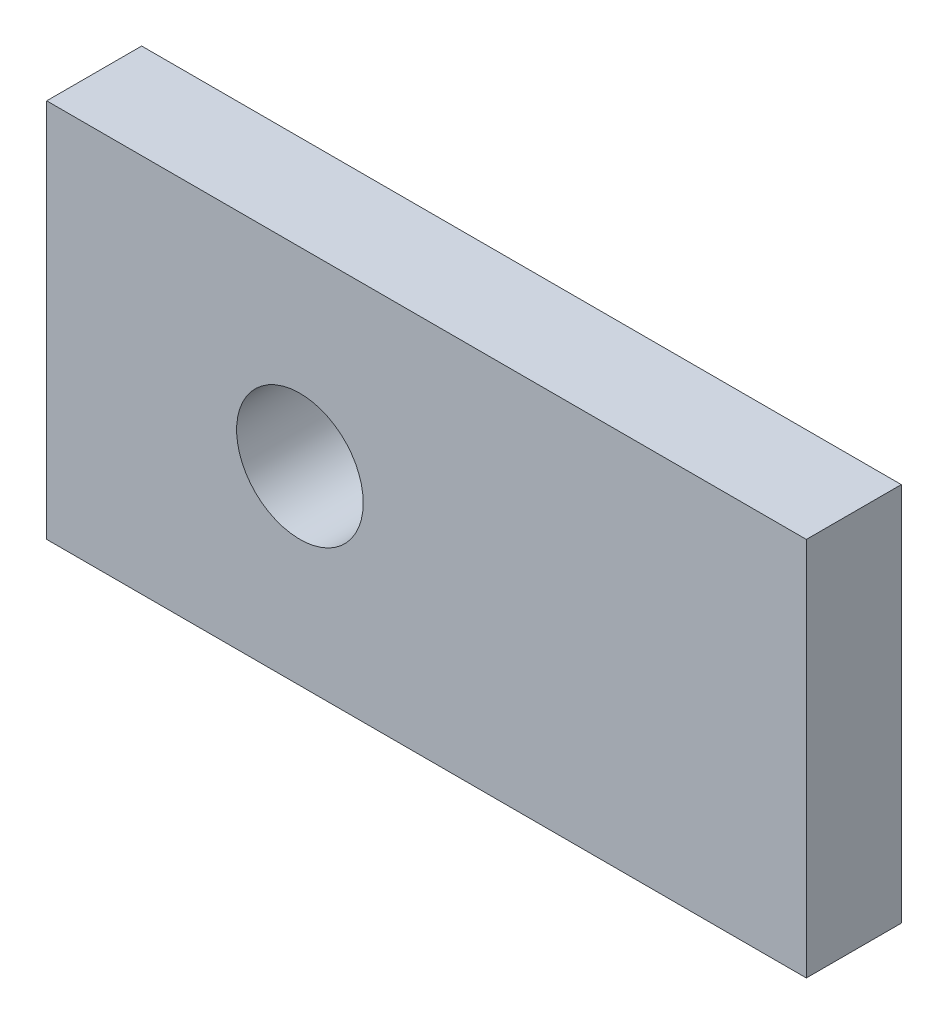
ISO-10303-21;
HEADER;
FILE_DESCRIPTION(('STEP AP214'),'2;1');
FILE_NAME('part.step','',(''),(''),'','','');
FILE_SCHEMA(('AUTOMOTIVE_DESIGN { 1 0 10303 214 1 1 1 1 }'));
ENDSEC;
DATA;
#1=APPLICATION_CONTEXT('core data for automotive mechanical design processes');
#2=APPLICATION_PROTOCOL_DEFINITION('international standard','automotive_design',2000,#1);
#3=PRODUCT_CONTEXT('',#1,'mechanical');
#4=PRODUCT('Part','Part','',(#3));
#5=PRODUCT_RELATED_PRODUCT_CATEGORY('part','',(#4));
#6=PRODUCT_DEFINITION_FORMATION('','',#4);
#7=PRODUCT_DEFINITION_CONTEXT('part definition',#1,'design');
#8=PRODUCT_DEFINITION('design','',#6,#7);
#9=PRODUCT_DEFINITION_SHAPE('','',#8);
#10=(LENGTH_UNIT() NAMED_UNIT(*) SI_UNIT(.MILLI.,.METRE.));
#11=(NAMED_UNIT(*) PLANE_ANGLE_UNIT() SI_UNIT($,.RADIAN.));
#12=(NAMED_UNIT(*) SI_UNIT($,.STERADIAN.) SOLID_ANGLE_UNIT());
#13=UNCERTAINTY_MEASURE_WITH_UNIT(LENGTH_MEASURE(1.E-05),#10,'distance_accuracy_value','');
#14=(GEOMETRIC_REPRESENTATION_CONTEXT(3) GLOBAL_UNCERTAINTY_ASSIGNED_CONTEXT((#13)) GLOBAL_UNIT_ASSIGNED_CONTEXT((#10,
#11,#12)) REPRESENTATION_CONTEXT('',''));
#15=CARTESIAN_POINT('',(0.,0.,0.));
#16=DIRECTION('',(0.,0.,1.));
#17=DIRECTION('',(1.,0.,0.));
#18=AXIS2_PLACEMENT_3D('',#15,#16,#17);
#19=CARTESIAN_POINT('',(60.,-30.,7.5));
#20=DIRECTION('',(0.,1.,0.));
#21=DIRECTION('',(0.,0.,1.));
#22=AXIS2_PLACEMENT_3D('',#19,#20,#21);
#23=PLANE('',#22);
#24=DIRECTION('',(0.,0.,-1.));
#25=VECTOR('',#24,1.);
#26=CARTESIAN_POINT('',(-60.,-30.,7.5));
#27=LINE('',#26,#25);
#28=CARTESIAN_POINT('',(-60.,-30.,7.5));
#29=VERTEX_POINT('',#28);
#30=CARTESIAN_POINT('',(-60.,-30.,-7.5));
#31=VERTEX_POINT('',#30);
#32=EDGE_CURVE('E117',#29,#31,#27,.T.);
#33=ORIENTED_EDGE('',*,*,#32,.T.);
#34=DIRECTION('',(-1.,0.,0.));
#35=VECTOR('',#34,1.);
#36=CARTESIAN_POINT('',(60.,-30.,-7.5));
#37=LINE('',#36,#35);
#38=CARTESIAN_POINT('',(60.,-30.,-7.5));
#39=VERTEX_POINT('',#38);
#40=EDGE_CURVE('E13',#39,#31,#37,.T.);
#41=ORIENTED_EDGE('',*,*,#40,.F.);
#42=DIRECTION('',(0.,0.,-1.));
#43=VECTOR('',#42,1.);
#44=CARTESIAN_POINT('',(60.,-30.,7.5));
#45=LINE('',#44,#43);
#46=CARTESIAN_POINT('',(60.,-30.,7.5));
#47=VERTEX_POINT('',#46);
#48=EDGE_CURVE('E104',#47,#39,#45,.T.);
#49=ORIENTED_EDGE('',*,*,#48,.F.);
#50=DIRECTION('',(-1.,0.,0.));
#51=VECTOR('',#50,1.);
#52=CARTESIAN_POINT('',(60.,-30.,7.5));
#53=LINE('',#52,#51);
#54=EDGE_CURVE('E112',#47,#29,#53,.T.);
#55=ORIENTED_EDGE('',*,*,#54,.T.);
#56=EDGE_LOOP('',(#33,#41,#49,#55));
#57=FACE_BOUND('',#56,.T.);
#58=ADVANCED_FACE('F53',(#57),#23,.F.);
#59=CARTESIAN_POINT('',(60.,-30.,-7.5));
#60=DIRECTION('',(0.,0.,1.));
#61=DIRECTION('',(1.,0.,0.));
#62=AXIS2_PLACEMENT_3D('',#59,#60,#61);
#63=PLANE('',#62);
#64=CARTESIAN_POINT('',(-20.,0.,-7.5));
#65=DIRECTION('',(0.,0.,1.));
#66=DIRECTION('',(1.,0.,0.));
#67=AXIS2_PLACEMENT_3D('',#64,#65,#66);
#68=CIRCLE('',#67,10.);
#69=CARTESIAN_POINT('',(-10.,0.,-7.5));
#70=VERTEX_POINT('',#69);
#71=EDGE_CURVE('E133',#70,#70,#68,.T.);
#72=ORIENTED_EDGE('',*,*,#71,.T.);
#73=EDGE_LOOP('',(#72));
#74=FACE_BOUND('',#73,.T.);
#75=DIRECTION('',(0.,1.,0.));
#76=VECTOR('',#75,1.);
#77=CARTESIAN_POINT('',(-60.,-30.,-7.5));
#78=LINE('',#77,#76);
#79=CARTESIAN_POINT('',(-60.,30.,-7.5));
#80=VERTEX_POINT('',#79);
#81=EDGE_CURVE('E108',#31,#80,#78,.T.);
#82=ORIENTED_EDGE('',*,*,#81,.T.);
#83=DIRECTION('',(-1.,0.,0.));
#84=VECTOR('',#83,1.);
#85=CARTESIAN_POINT('',(60.,30.,-7.5));
#86=LINE('',#85,#84);
#87=CARTESIAN_POINT('',(60.,30.,-7.5));
#88=VERTEX_POINT('',#87);
#89=EDGE_CURVE('E61',#88,#80,#86,.T.);
#90=ORIENTED_EDGE('',*,*,#89,.F.);
#91=DIRECTION('',(0.,1.,0.));
#92=VECTOR('',#91,1.);
#93=CARTESIAN_POINT('',(60.,-30.,-7.5));
#94=LINE('',#93,#92);
#95=EDGE_CURVE('E99',#39,#88,#94,.T.);
#96=ORIENTED_EDGE('',*,*,#95,.F.);
#97=ORIENTED_EDGE('',*,*,#40,.T.);
#98=EDGE_LOOP('',(#82,#90,#96,#97));
#99=FACE_BOUND('',#98,.T.);
#100=ADVANCED_FACE('F107',(#74,#99),#63,.F.);
#101=CARTESIAN_POINT('',(60.,30.,7.5));
#102=DIRECTION('',(0.,-1.,0.));
#103=DIRECTION('',(0.,0.,-1.));
#104=AXIS2_PLACEMENT_3D('',#101,#102,#103);
#105=PLANE('',#104);
#106=DIRECTION('',(0.,0.,1.));
#107=VECTOR('',#106,1.);
#108=CARTESIAN_POINT('',(-60.,30.,7.5));
#109=LINE('',#108,#107);
#110=CARTESIAN_POINT('',(-60.,30.,7.5));
#111=VERTEX_POINT('',#110);
#112=EDGE_CURVE('E86',#80,#111,#109,.T.);
#113=ORIENTED_EDGE('',*,*,#112,.T.);
#114=DIRECTION('',(-1.,0.,0.));
#115=VECTOR('',#114,1.);
#116=CARTESIAN_POINT('',(60.,30.,7.5));
#117=LINE('',#116,#115);
#118=CARTESIAN_POINT('',(60.,30.,7.5));
#119=VERTEX_POINT('',#118);
#120=EDGE_CURVE('E109',#119,#111,#117,.T.);
#121=ORIENTED_EDGE('',*,*,#120,.F.);
#122=DIRECTION('',(0.,0.,1.));
#123=VECTOR('',#122,1.);
#124=CARTESIAN_POINT('',(60.,30.,7.5));
#125=LINE('',#124,#123);
#126=EDGE_CURVE('E102',#88,#119,#125,.T.);
#127=ORIENTED_EDGE('',*,*,#126,.F.);
#128=ORIENTED_EDGE('',*,*,#89,.T.);
#129=EDGE_LOOP('',(#113,#121,#127,#128));
#130=FACE_BOUND('',#129,.T.);
#131=ADVANCED_FACE('F110',(#130),#105,.F.);
#132=CARTESIAN_POINT('',(60.,-30.,7.5));
#133=DIRECTION('',(0.,0.,-1.));
#134=DIRECTION('',(-1.,0.,0.));
#135=AXIS2_PLACEMENT_3D('',#132,#133,#134);
#136=PLANE('',#135);
#137=CARTESIAN_POINT('',(-20.,0.,7.5));
#138=DIRECTION('',(0.,0.,1.));
#139=DIRECTION('',(1.,0.,0.));
#140=AXIS2_PLACEMENT_3D('',#137,#138,#139);
#141=CIRCLE('',#140,10.);
#142=CARTESIAN_POINT('',(-10.,0.,7.5));
#143=VERTEX_POINT('',#142);
#144=EDGE_CURVE('E136',#143,#143,#141,.T.);
#145=ORIENTED_EDGE('',*,*,#144,.F.);
#146=EDGE_LOOP('',(#145));
#147=FACE_BOUND('',#146,.T.);
#148=DIRECTION('',(0.,-1.,0.));
#149=VECTOR('',#148,1.);
#150=CARTESIAN_POINT('',(-60.,-30.,7.5));
#151=LINE('',#150,#149);
#152=EDGE_CURVE('E92',#111,#29,#151,.T.);
#153=ORIENTED_EDGE('',*,*,#152,.T.);
#154=ORIENTED_EDGE('',*,*,#54,.F.);
#155=DIRECTION('',(0.,-1.,0.));
#156=VECTOR('',#155,1.);
#157=CARTESIAN_POINT('',(60.,-30.,7.5));
#158=LINE('',#157,#156);
#159=EDGE_CURVE('E69',#119,#47,#158,.T.);
#160=ORIENTED_EDGE('',*,*,#159,.F.);
#161=ORIENTED_EDGE('',*,*,#120,.T.);
#162=EDGE_LOOP('',(#153,#154,#160,#161));
#163=FACE_BOUND('',#162,.T.);
#164=ADVANCED_FACE('F128',(#147,#163),#136,.F.);
#165=CARTESIAN_POINT('',(60.,-30.,-7.5));
#166=DIRECTION('',(1.,0.,0.));
#167=DIRECTION('',(0.,0.,-1.));
#168=AXIS2_PLACEMENT_3D('',#165,#166,#167);
#169=PLANE('',#168);
#170=ORIENTED_EDGE('',*,*,#48,.T.);
#171=ORIENTED_EDGE('',*,*,#95,.T.);
#172=ORIENTED_EDGE('',*,*,#126,.T.);
#173=ORIENTED_EDGE('',*,*,#159,.T.);
#174=EDGE_LOOP('',(#170,#171,#172,#173));
#175=FACE_BOUND('',#174,.T.);
#176=ADVANCED_FACE('F100',(#175),#169,.T.);
#177=CARTESIAN_POINT('',(-60.,-30.,-7.5));
#178=DIRECTION('',(1.,0.,0.));
#179=DIRECTION('',(0.,0.,-1.));
#180=AXIS2_PLACEMENT_3D('',#177,#178,#179);
#181=PLANE('',#180);
#182=ORIENTED_EDGE('',*,*,#32,.F.);
#183=ORIENTED_EDGE('',*,*,#152,.F.);
#184=ORIENTED_EDGE('',*,*,#112,.F.);
#185=ORIENTED_EDGE('',*,*,#81,.F.);
#186=EDGE_LOOP('',(#182,#183,#184,#185));
#187=FACE_BOUND('',#186,.T.);
#188=ADVANCED_FACE('F131',(#187),#181,.F.);
#189=CARTESIAN_POINT('',(-20.,0.,-12.5));
#190=DIRECTION('',(0.,0.,1.));
#191=DIRECTION('',(1.,0.,0.));
#192=AXIS2_PLACEMENT_3D('',#189,#190,#191);
#193=CYLINDRICAL_SURFACE('',#192,10.);
#194=ORIENTED_EDGE('',*,*,#144,.T.);
#195=EDGE_LOOP('',(#194));
#196=FACE_BOUND('',#195,.T.);
#197=ORIENTED_EDGE('',*,*,#71,.F.);
#198=EDGE_LOOP('',(#197));
#199=FACE_BOUND('',#198,.T.);
#200=ADVANCED_FACE('F145',(#196,#199),#193,.F.);
#201=CLOSED_SHELL('',(#58,#100,#131,#164,#176,#188,#200));
#202=MANIFOLD_SOLID_BREP('B2',#201);
#203=ADVANCED_BREP_SHAPE_REPRESENTATION('',(#18,#202),#14);
#204=SHAPE_DEFINITION_REPRESENTATION(#9,#203);
ENDSEC;
END-ISO-10303-21;
